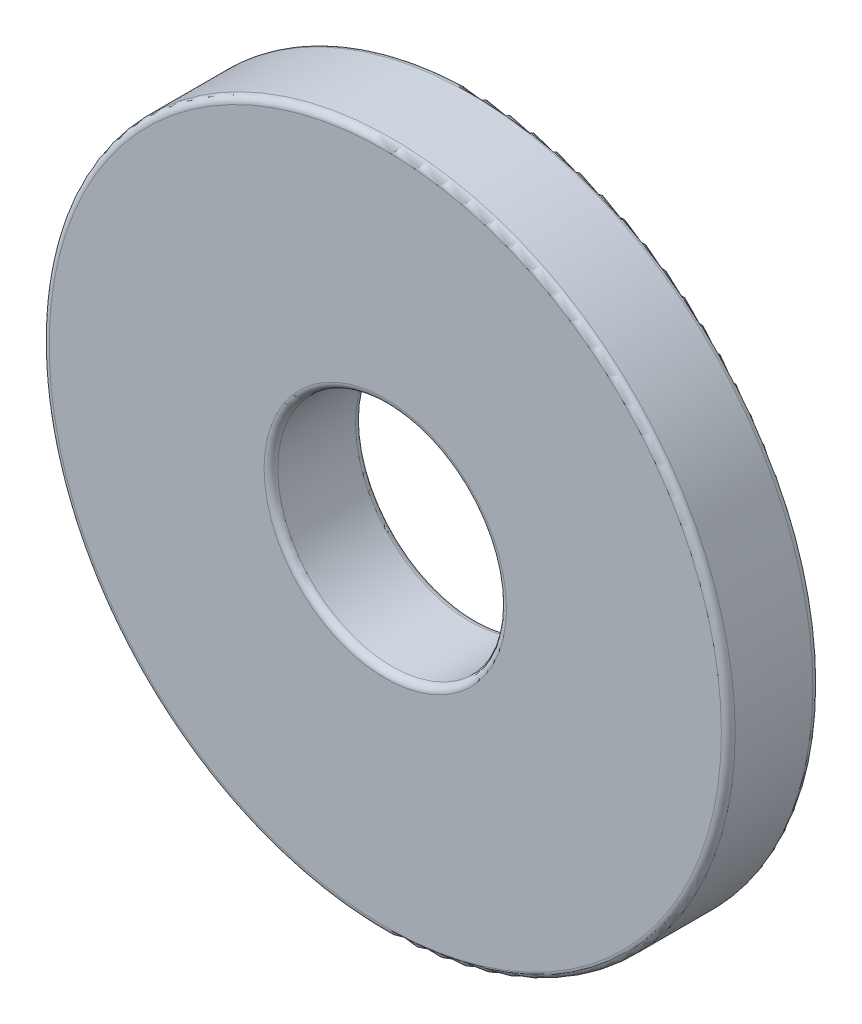
ISO-10303-21;
HEADER;
FILE_DESCRIPTION(('STEP AP214'),'2;1');
FILE_NAME('part.step','',(''),(''),'','','');
FILE_SCHEMA(('AUTOMOTIVE_DESIGN { 1 0 10303 214 1 1 1 1 }'));
ENDSEC;
DATA;
#1=APPLICATION_CONTEXT('core data for automotive mechanical design processes');
#2=APPLICATION_PROTOCOL_DEFINITION('international standard','automotive_design',2000,#1);
#3=PRODUCT_CONTEXT('',#1,'mechanical');
#4=PRODUCT('Part','Part','',(#3));
#5=PRODUCT_RELATED_PRODUCT_CATEGORY('part','',(#4));
#6=PRODUCT_DEFINITION_FORMATION('','',#4);
#7=PRODUCT_DEFINITION_CONTEXT('part definition',#1,'design');
#8=PRODUCT_DEFINITION('design','',#6,#7);
#9=PRODUCT_DEFINITION_SHAPE('','',#8);
#10=(LENGTH_UNIT() NAMED_UNIT(*) SI_UNIT(.MILLI.,.METRE.));
#11=(NAMED_UNIT(*) PLANE_ANGLE_UNIT() SI_UNIT($,.RADIAN.));
#12=(NAMED_UNIT(*) SI_UNIT($,.STERADIAN.) SOLID_ANGLE_UNIT());
#13=UNCERTAINTY_MEASURE_WITH_UNIT(LENGTH_MEASURE(1.E-05),#10,'distance_accuracy_value','');
#14=(GEOMETRIC_REPRESENTATION_CONTEXT(3) GLOBAL_UNCERTAINTY_ASSIGNED_CONTEXT((#13)) GLOBAL_UNIT_ASSIGNED_CONTEXT((#10,
#11,#12)) REPRESENTATION_CONTEXT('',''));
#15=CARTESIAN_POINT('',(0.,0.,0.));
#16=DIRECTION('',(0.,0.,1.));
#17=DIRECTION('',(1.,0.,0.));
#18=AXIS2_PLACEMENT_3D('',#15,#16,#17);
#19=CARTESIAN_POINT('',(0.,0.,2.));
#20=DIRECTION('',(0.,0.,1.));
#21=DIRECTION('',(1.,0.,0.));
#22=AXIS2_PLACEMENT_3D('',#19,#20,#21);
#23=PLANE('',#22);
#24=CARTESIAN_POINT('',(0.,0.,2.));
#25=DIRECTION('',(0.,0.,1.));
#26=DIRECTION('',(1.,0.,0.));
#27=AXIS2_PLACEMENT_3D('',#24,#25,#26);
#28=CIRCLE('',#27,2.65);
#29=CARTESIAN_POINT('',(2.65,0.,2.));
#30=VERTEX_POINT('',#29);
#31=EDGE_CURVE('E10',#30,#30,#28,.F.);
#32=ORIENTED_EDGE('',*,*,#31,.T.);
#33=EDGE_LOOP('',(#32));
#34=FACE_BOUND('',#33,.T.);
#35=CARTESIAN_POINT('',(0.,0.,2.));
#36=DIRECTION('',(0.,0.,1.));
#37=DIRECTION('',(1.,0.,0.));
#38=AXIS2_PLACEMENT_3D('',#35,#36,#37);
#39=CIRCLE('',#38,7.35);
#40=CARTESIAN_POINT('',(7.35,0.,2.));
#41=VERTEX_POINT('',#40);
#42=EDGE_CURVE('E38',#41,#41,#39,.T.);
#43=ORIENTED_EDGE('',*,*,#42,.T.);
#44=EDGE_LOOP('',(#43));
#45=FACE_BOUND('',#44,.T.);
#46=ADVANCED_FACE('F31',(#34,#45),#23,.T.);
#47=CARTESIAN_POINT('',(0.,0.,0.));
#48=DIRECTION('',(0.,0.,1.));
#49=DIRECTION('',(1.,0.,0.));
#50=AXIS2_PLACEMENT_3D('',#47,#48,#49);
#51=PLANE('',#50);
#52=CARTESIAN_POINT('',(0.,0.,0.));
#53=DIRECTION('',(0.,0.,1.));
#54=DIRECTION('',(1.,0.,0.));
#55=AXIS2_PLACEMENT_3D('',#52,#53,#54);
#56=CIRCLE('',#55,2.65);
#57=CARTESIAN_POINT('',(2.65,0.,0.));
#58=VERTEX_POINT('',#57);
#59=EDGE_CURVE('E57',#58,#58,#56,.T.);
#60=ORIENTED_EDGE('',*,*,#59,.T.);
#61=EDGE_LOOP('',(#60));
#62=FACE_BOUND('',#61,.T.);
#63=CARTESIAN_POINT('',(0.,0.,0.));
#64=DIRECTION('',(0.,0.,1.));
#65=DIRECTION('',(1.,0.,0.));
#66=AXIS2_PLACEMENT_3D('',#63,#64,#65);
#67=CIRCLE('',#66,7.35);
#68=CARTESIAN_POINT('',(7.35,0.,0.));
#69=VERTEX_POINT('',#68);
#70=EDGE_CURVE('E60',#69,#69,#67,.F.);
#71=ORIENTED_EDGE('',*,*,#70,.T.);
#72=EDGE_LOOP('',(#71));
#73=FACE_BOUND('',#72,.T.);
#74=ADVANCED_FACE('F64',(#62,#73),#51,.F.);
#75=CARTESIAN_POINT('',(0.,0.,2.));
#76=DIRECTION('',(0.,0.,-1.));
#77=DIRECTION('',(-1.,0.,0.));
#78=AXIS2_PLACEMENT_3D('',#75,#76,#77);
#79=CYLINDRICAL_SURFACE('',#78,7.5);
#80=CARTESIAN_POINT('',(0.,0.,0.15));
#81=DIRECTION('',(0.,0.,1.));
#82=DIRECTION('',(1.,0.,0.));
#83=AXIS2_PLACEMENT_3D('',#80,#81,#82);
#84=CIRCLE('',#83,7.5);
#85=CARTESIAN_POINT('',(7.5,0.,0.15));
#86=VERTEX_POINT('',#85);
#87=EDGE_CURVE('E42',#86,#86,#84,.T.);
#88=ORIENTED_EDGE('',*,*,#87,.T.);
#89=EDGE_LOOP('',(#88));
#90=FACE_BOUND('',#89,.T.);
#91=CARTESIAN_POINT('',(0.,0.,1.85));
#92=DIRECTION('',(0.,0.,1.));
#93=DIRECTION('',(1.,0.,0.));
#94=AXIS2_PLACEMENT_3D('',#91,#92,#93);
#95=CIRCLE('',#94,7.5);
#96=CARTESIAN_POINT('',(7.5,0.,1.85));
#97=VERTEX_POINT('',#96);
#98=EDGE_CURVE('E46',#97,#97,#95,.F.);
#99=ORIENTED_EDGE('',*,*,#98,.T.);
#100=EDGE_LOOP('',(#99));
#101=FACE_BOUND('',#100,.T.);
#102=ADVANCED_FACE('F74',(#90,#101),#79,.T.);
#103=CARTESIAN_POINT('',(0.,0.,2.));
#104=DIRECTION('',(0.,0.,-1.));
#105=DIRECTION('',(-1.,0.,0.));
#106=AXIS2_PLACEMENT_3D('',#103,#104,#105);
#107=CYLINDRICAL_SURFACE('',#106,2.5);
#108=CARTESIAN_POINT('',(0.,0.,0.15));
#109=DIRECTION('',(0.,0.,1.));
#110=DIRECTION('',(1.,0.,0.));
#111=AXIS2_PLACEMENT_3D('',#108,#109,#110);
#112=CIRCLE('',#111,2.5);
#113=CARTESIAN_POINT('',(2.5,0.,0.15));
#114=VERTEX_POINT('',#113);
#115=EDGE_CURVE('E51',#114,#114,#112,.F.);
#116=ORIENTED_EDGE('',*,*,#115,.T.);
#117=EDGE_LOOP('',(#116));
#118=FACE_BOUND('',#117,.T.);
#119=CARTESIAN_POINT('',(0.,0.,1.85));
#120=DIRECTION('',(0.,0.,1.));
#121=DIRECTION('',(1.,0.,0.));
#122=AXIS2_PLACEMENT_3D('',#119,#120,#121);
#123=CIRCLE('',#122,2.5);
#124=CARTESIAN_POINT('',(2.5,0.,1.85));
#125=VERTEX_POINT('',#124);
#126=EDGE_CURVE('E54',#125,#125,#123,.T.);
#127=ORIENTED_EDGE('',*,*,#126,.T.);
#128=EDGE_LOOP('',(#127));
#129=FACE_BOUND('',#128,.T.);
#130=ADVANCED_FACE('F77',(#118,#129),#107,.F.);
#131=CARTESIAN_POINT('',(0.,0.,0.15));
#132=DIRECTION('',(0.,0.,1.));
#133=DIRECTION('',(1.,0.,0.));
#134=AXIS2_PLACEMENT_3D('',#131,#132,#133);
#135=TOROIDAL_SURFACE('',#134,2.65,0.15);
#136=ORIENTED_EDGE('',*,*,#115,.F.);
#137=EDGE_LOOP('',(#136));
#138=FACE_BOUND('',#137,.T.);
#139=ORIENTED_EDGE('',*,*,#59,.F.);
#140=EDGE_LOOP('',(#139));
#141=FACE_BOUND('',#140,.T.);
#142=ADVANCED_FACE('F70',(#138,#141),#135,.T.);
#143=CARTESIAN_POINT('',(0.,0.,0.15));
#144=DIRECTION('',(0.,0.,1.));
#145=DIRECTION('',(1.,0.,0.));
#146=AXIS2_PLACEMENT_3D('',#143,#144,#145);
#147=TOROIDAL_SURFACE('',#146,7.35,0.15);
#148=ORIENTED_EDGE('',*,*,#70,.F.);
#149=EDGE_LOOP('',(#148));
#150=FACE_BOUND('',#149,.T.);
#151=ORIENTED_EDGE('',*,*,#87,.F.);
#152=EDGE_LOOP('',(#151));
#153=FACE_BOUND('',#152,.T.);
#154=ADVANCED_FACE('F66',(#150,#153),#147,.T.);
#155=CARTESIAN_POINT('',(0.,0.,1.85));
#156=DIRECTION('',(0.,0.,1.));
#157=DIRECTION('',(1.,0.,0.));
#158=AXIS2_PLACEMENT_3D('',#155,#156,#157);
#159=TOROIDAL_SURFACE('',#158,2.65,0.15);
#160=ORIENTED_EDGE('',*,*,#31,.F.);
#161=EDGE_LOOP('',(#160));
#162=FACE_BOUND('',#161,.T.);
#163=ORIENTED_EDGE('',*,*,#126,.F.);
#164=EDGE_LOOP('',(#163));
#165=FACE_BOUND('',#164,.T.);
#166=ADVANCED_FACE('F69',(#162,#165),#159,.T.);
#167=CARTESIAN_POINT('',(0.,0.,1.85));
#168=DIRECTION('',(0.,0.,1.));
#169=DIRECTION('',(1.,0.,0.));
#170=AXIS2_PLACEMENT_3D('',#167,#168,#169);
#171=TOROIDAL_SURFACE('',#170,7.35,0.15);
#172=ORIENTED_EDGE('',*,*,#98,.F.);
#173=EDGE_LOOP('',(#172));
#174=FACE_BOUND('',#173,.T.);
#175=ORIENTED_EDGE('',*,*,#42,.F.);
#176=EDGE_LOOP('',(#175));
#177=FACE_BOUND('',#176,.T.);
#178=ADVANCED_FACE('F33',(#174,#177),#171,.T.);
#179=CLOSED_SHELL('',(#46,#74,#102,#130,#142,#154,#166,#178));
#180=MANIFOLD_SOLID_BREP('B2',#179);
#181=ADVANCED_BREP_SHAPE_REPRESENTATION('',(#18,#180),#14);
#182=SHAPE_DEFINITION_REPRESENTATION(#9,#181);
ENDSEC;
END-ISO-10303-21;
